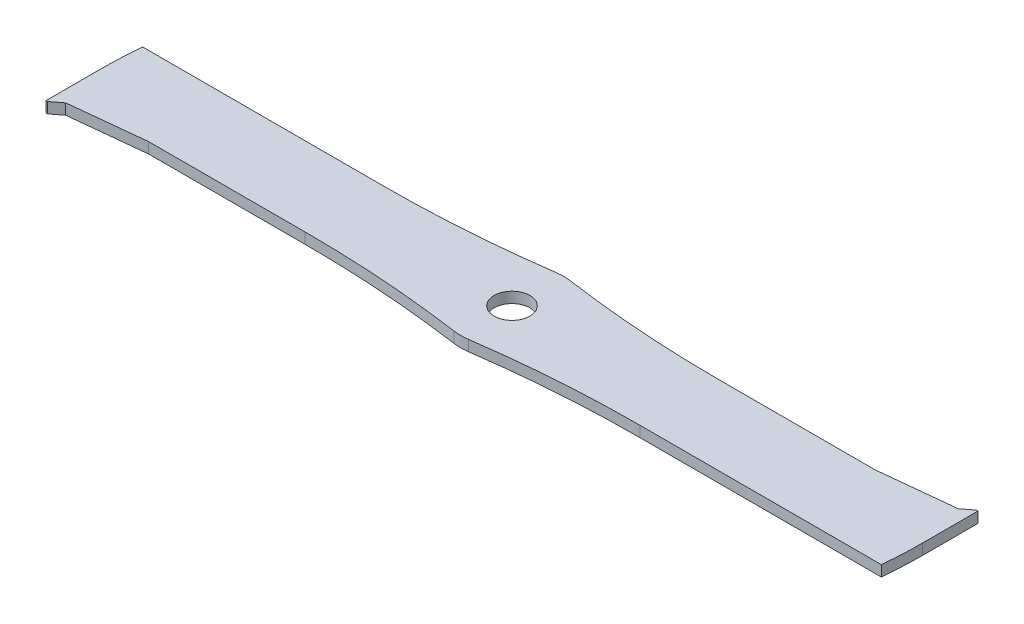
ISO-10303-21;
HEADER;
FILE_DESCRIPTION(('STEP AP214'),'2;1');
FILE_NAME('part.step','',(''),(''),'','','');
FILE_SCHEMA(('AUTOMOTIVE_DESIGN { 1 0 10303 214 1 1 1 1 }'));
ENDSEC;
DATA;
#1=APPLICATION_CONTEXT('core data for automotive mechanical design processes');
#2=APPLICATION_PROTOCOL_DEFINITION('international standard','automotive_design',2000,#1);
#3=PRODUCT_CONTEXT('',#1,'mechanical');
#4=PRODUCT('Part','Part','',(#3));
#5=PRODUCT_RELATED_PRODUCT_CATEGORY('part','',(#4));
#6=PRODUCT_DEFINITION_FORMATION('','',#4);
#7=PRODUCT_DEFINITION_CONTEXT('part definition',#1,'design');
#8=PRODUCT_DEFINITION('design','',#6,#7);
#9=PRODUCT_DEFINITION_SHAPE('','',#8);
#10=(LENGTH_UNIT() NAMED_UNIT(*) SI_UNIT(.MILLI.,.METRE.));
#11=(NAMED_UNIT(*) PLANE_ANGLE_UNIT() SI_UNIT($,.RADIAN.));
#12=(NAMED_UNIT(*) SI_UNIT($,.STERADIAN.) SOLID_ANGLE_UNIT());
#13=UNCERTAINTY_MEASURE_WITH_UNIT(LENGTH_MEASURE(1.E-05),#10,'distance_accuracy_value','');
#14=(GEOMETRIC_REPRESENTATION_CONTEXT(3) GLOBAL_UNCERTAINTY_ASSIGNED_CONTEXT((#13)) GLOBAL_UNIT_ASSIGNED_CONTEXT((#10,
#11,#12)) REPRESENTATION_CONTEXT('',''));
#15=CARTESIAN_POINT('',(0.,0.,0.));
#16=DIRECTION('',(0.,0.,1.));
#17=DIRECTION('',(1.,0.,0.));
#18=AXIS2_PLACEMENT_3D('',#15,#16,#17);
#19=CARTESIAN_POINT('',(-165.1,2.159,15.875));
#20=DIRECTION('',(1.,0.,0.));
#21=DIRECTION('',(0.,0.,-1.));
#22=AXIS2_PLACEMENT_3D('',#19,#20,#21);
#23=PLANE('',#22);
#24=DIRECTION('',(0.,-1.,0.));
#25=VECTOR('',#24,1.);
#26=CARTESIAN_POINT('',(-165.1,2.159,0.));
#27=LINE('',#26,#25);
#28=CARTESIAN_POINT('',(-165.1,2.159,0.));
#29=VERTEX_POINT('',#28);
#30=CARTESIAN_POINT('',(-165.1,-2.159,0.));
#31=VERTEX_POINT('',#30);
#32=EDGE_CURVE('E172',#29,#31,#27,.T.);
#33=ORIENTED_EDGE('',*,*,#32,.T.);
#34=DIRECTION('',(0.,0.,1.));
#35=VECTOR('',#34,1.);
#36=CARTESIAN_POINT('',(-165.1,-2.159,15.875));
#37=LINE('',#36,#35);
#38=CARTESIAN_POINT('',(-165.1,-2.159,22.225));
#39=VERTEX_POINT('',#38);
#40=EDGE_CURVE('E210',#31,#39,#37,.T.);
#41=ORIENTED_EDGE('',*,*,#40,.T.);
#42=DIRECTION('',(0.,-1.,0.));
#43=VECTOR('',#42,1.);
#44=CARTESIAN_POINT('',(-165.1,37.6565791428091,22.225));
#45=LINE('',#44,#43);
#46=CARTESIAN_POINT('',(-165.1,2.159,22.225));
#47=VERTEX_POINT('',#46);
#48=EDGE_CURVE('E193',#47,#39,#45,.T.);
#49=ORIENTED_EDGE('',*,*,#48,.F.);
#50=DIRECTION('',(0.,0.,1.));
#51=VECTOR('',#50,1.);
#52=CARTESIAN_POINT('',(-165.1,2.159,15.875));
#53=LINE('',#52,#51);
#54=EDGE_CURVE('E186',#29,#47,#53,.T.);
#55=ORIENTED_EDGE('',*,*,#54,.F.);
#56=EDGE_LOOP('',(#33,#41,#49,#55));
#57=FACE_BOUND('',#56,.T.);
#58=ADVANCED_FACE('F39',(#57),#23,.F.);
#59=CARTESIAN_POINT('',(165.1,2.159,15.875));
#60=DIRECTION('',(-1.,0.,0.));
#61=DIRECTION('',(0.,0.,1.));
#62=AXIS2_PLACEMENT_3D('',#59,#60,#61);
#63=PLANE('',#62);
#64=DIRECTION('',(0.,-1.,0.));
#65=VECTOR('',#64,1.);
#66=CARTESIAN_POINT('',(165.1,2.159,0.));
#67=LINE('',#66,#65);
#68=CARTESIAN_POINT('',(165.1,2.159,0.));
#69=VERTEX_POINT('',#68);
#70=CARTESIAN_POINT('',(165.1,-2.159,0.));
#71=VERTEX_POINT('',#70);
#72=EDGE_CURVE('E330',#69,#71,#67,.T.);
#73=ORIENTED_EDGE('',*,*,#72,.T.);
#74=DIRECTION('',(0.,0.,-1.));
#75=VECTOR('',#74,1.);
#76=CARTESIAN_POINT('',(165.1,-2.159,15.875));
#77=LINE('',#76,#75);
#78=CARTESIAN_POINT('',(165.1,-2.159,-22.225));
#79=VERTEX_POINT('',#78);
#80=EDGE_CURVE('E204',#71,#79,#77,.T.);
#81=ORIENTED_EDGE('',*,*,#80,.T.);
#82=DIRECTION('',(0.,-1.,0.));
#83=VECTOR('',#82,1.);
#84=CARTESIAN_POINT('',(165.1,37.6565791428091,-22.225));
#85=LINE('',#84,#83);
#86=CARTESIAN_POINT('',(165.1,2.159,-22.225));
#87=VERTEX_POINT('',#86);
#88=EDGE_CURVE('E315',#87,#79,#85,.T.);
#89=ORIENTED_EDGE('',*,*,#88,.F.);
#90=DIRECTION('',(0.,0.,-1.));
#91=VECTOR('',#90,1.);
#92=CARTESIAN_POINT('',(165.1,2.159,15.875));
#93=LINE('',#92,#91);
#94=EDGE_CURVE('E215',#69,#87,#93,.T.);
#95=ORIENTED_EDGE('',*,*,#94,.F.);
#96=EDGE_LOOP('',(#73,#81,#89,#95));
#97=FACE_BOUND('',#96,.T.);
#98=ADVANCED_FACE('F380',(#97),#63,.F.);
#99=CARTESIAN_POINT('',(-165.1,2.159,-15.875));
#100=DIRECTION('',(0.,0.,1.));
#101=DIRECTION('',(1.,0.,0.));
#102=AXIS2_PLACEMENT_3D('',#99,#100,#101);
#103=PLANE('',#102);
#104=DIRECTION('',(-1.,0.,0.));
#105=VECTOR('',#104,1.);
#106=CARTESIAN_POINT('',(-165.1,2.159,-15.875));
#107=LINE('',#106,#105);
#108=CARTESIAN_POINT('',(130.175000000001,2.159,-15.875));
#109=VERTEX_POINT('',#108);
#110=CARTESIAN_POINT('',(67.2957709016692,2.159,-15.875));
#111=VERTEX_POINT('',#110);
#112=EDGE_CURVE('E195',#109,#111,#107,.T.);
#113=ORIENTED_EDGE('',*,*,#112,.F.);
#114=DIRECTION('',(0.,-1.,0.));
#115=VECTOR('',#114,1.);
#116=CARTESIAN_POINT('',(130.175,37.6565791428091,-15.875));
#117=LINE('',#116,#115);
#118=CARTESIAN_POINT('',(130.175000000001,-2.159,-15.875));
#119=VERTEX_POINT('',#118);
#120=EDGE_CURVE('E308',#109,#119,#117,.T.);
#121=ORIENTED_EDGE('',*,*,#120,.T.);
#122=DIRECTION('',(-1.,0.,0.));
#123=VECTOR('',#122,1.);
#124=CARTESIAN_POINT('',(-165.1,-2.159,-15.875));
#125=LINE('',#124,#123);
#126=CARTESIAN_POINT('',(67.2957709016692,-2.159,-15.875));
#127=VERTEX_POINT('',#126);
#128=EDGE_CURVE('E208',#119,#127,#125,.T.);
#129=ORIENTED_EDGE('',*,*,#128,.T.);
#130=DIRECTION('',(0.,1.,0.));
#131=VECTOR('',#130,1.);
#132=CARTESIAN_POINT('',(67.2957709016692,2.159,-15.875));
#133=LINE('',#132,#131);
#134=EDGE_CURVE('E225',#127,#111,#133,.T.);
#135=ORIENTED_EDGE('',*,*,#134,.T.);
#136=EDGE_LOOP('',(#113,#121,#129,#135));
#137=FACE_BOUND('',#136,.T.);
#138=ADVANCED_FACE('F399',(#137),#103,.F.);
#139=CARTESIAN_POINT('',(-165.1,2.159,15.875));
#140=DIRECTION('',(0.,0.,-1.));
#141=DIRECTION('',(-1.,0.,0.));
#142=AXIS2_PLACEMENT_3D('',#139,#140,#141);
#143=PLANE('',#142);
#144=DIRECTION('',(1.,0.,0.));
#145=VECTOR('',#144,1.);
#146=CARTESIAN_POINT('',(-165.1,2.159,15.875));
#147=LINE('',#146,#145);
#148=CARTESIAN_POINT('',(-130.175000000003,2.159,15.8750000000001));
#149=VERTEX_POINT('',#148);
#150=CARTESIAN_POINT('',(-67.2957709016691,2.159,15.875));
#151=VERTEX_POINT('',#150);
#152=EDGE_CURVE('E198',#149,#151,#147,.T.);
#153=ORIENTED_EDGE('',*,*,#152,.F.);
#154=DIRECTION('',(0.,-1.,0.));
#155=VECTOR('',#154,1.);
#156=CARTESIAN_POINT('',(-130.175,37.6565791428091,15.875));
#157=LINE('',#156,#155);
#158=CARTESIAN_POINT('',(-130.175000000003,-2.159,15.8750000000001));
#159=VERTEX_POINT('',#158);
#160=EDGE_CURVE('E285',#149,#159,#157,.T.);
#161=ORIENTED_EDGE('',*,*,#160,.T.);
#162=DIRECTION('',(1.,0.,0.));
#163=VECTOR('',#162,1.);
#164=CARTESIAN_POINT('',(-165.1,-2.159,15.875));
#165=LINE('',#164,#163);
#166=CARTESIAN_POINT('',(-67.2957709016691,-2.159,15.875));
#167=VERTEX_POINT('',#166);
#168=EDGE_CURVE('E213',#159,#167,#165,.T.);
#169=ORIENTED_EDGE('',*,*,#168,.T.);
#170=DIRECTION('',(0.,1.,0.));
#171=VECTOR('',#170,1.);
#172=CARTESIAN_POINT('',(-67.2957709016691,2.159,15.875));
#173=LINE('',#172,#171);
#174=EDGE_CURVE('E203',#167,#151,#173,.T.);
#175=ORIENTED_EDGE('',*,*,#174,.T.);
#176=EDGE_LOOP('',(#153,#161,#169,#175));
#177=FACE_BOUND('',#176,.T.);
#178=ADVANCED_FACE('F361',(#177),#143,.F.);
#179=CARTESIAN_POINT('',(0.,2.159,0.));
#180=DIRECTION('',(0.,-1.,0.));
#181=DIRECTION('',(0.,0.,-1.));
#182=AXIS2_PLACEMENT_3D('',#179,#180,#181);
#183=PLANE('',#182);
#184=CARTESIAN_POINT('',(-67.2957709016691,2.159,-15.875));
#185=VERTEX_POINT('',#184);
#186=CARTESIAN_POINT('',(-164.335006541516,2.159,-15.875));
#187=VERTEX_POINT('',#186);
#188=EDGE_CURVE('E189',#185,#187,#107,.T.);
#189=ORIENTED_EDGE('',*,*,#188,.T.);
#190=CARTESIAN_POINT('',(1.16573417585641E-11,2.159,0.));
#191=DIRECTION('',(0.,1.,0.));
#192=DIRECTION('',(0.,0.,-1.));
#193=AXIS2_PLACEMENT_3D('',#190,#191,#192);
#194=CIRCLE('',#193,165.100000000012);
#195=EDGE_CURVE('E175',#187,#29,#194,.T.);
#196=ORIENTED_EDGE('',*,*,#195,.T.);
#197=ORIENTED_EDGE('',*,*,#54,.T.);
#198=DIRECTION('',(1.,0.,0.));
#199=VECTOR('',#198,1.);
#200=CARTESIAN_POINT('',(-165.1,2.159,22.225));
#201=LINE('',#200,#199);
#202=CARTESIAN_POINT('',(-164.465,2.159,22.225));
#203=VERTEX_POINT('',#202);
#204=EDGE_CURVE('E284',#47,#203,#201,.T.);
#205=ORIENTED_EDGE('',*,*,#204,.T.);
#206=DIRECTION('',(0.792623989104601,0.,-0.609710760849692));
#207=VECTOR('',#206,1.);
#208=CARTESIAN_POINT('',(-164.465,2.159,22.225));
#209=LINE('',#208,#207);
#210=CARTESIAN_POINT('',(-160.3375,2.159,19.05));
#211=VERTEX_POINT('',#210);
#212=EDGE_CURVE('E293',#203,#211,#209,.T.);
#213=ORIENTED_EDGE('',*,*,#212,.T.);
#214=DIRECTION('',(0.994505452921406,0.,-0.104684784518043));
#215=VECTOR('',#214,1.);
#216=CARTESIAN_POINT('',(-160.3375,2.159,19.05));
#217=LINE('',#216,#215);
#218=EDGE_CURVE('E266',#211,#149,#217,.T.);
#219=ORIENTED_EDGE('',*,*,#218,.T.);
#220=ORIENTED_EDGE('',*,*,#152,.T.);
#221=CARTESIAN_POINT('',(-67.2957709016691,2.159,473.075));
#222=DIRECTION('',(0.,-1.,0.));
#223=DIRECTION('',(0.,0.,-1.));
#224=AXIS2_PLACEMENT_3D('',#221,#222,#223);
#225=CIRCLE('',#224,457.2);
#226=CARTESIAN_POINT('',(-2.90646186618505,2.159,20.4318106312292));
#227=VERTEX_POINT('',#226);
#228=EDGE_CURVE('E235',#151,#227,#225,.T.);
#229=ORIENTED_EDGE('',*,*,#228,.T.);
#230=CARTESIAN_POINT('',(0.,2.159,0.));
#231=DIRECTION('',(0.,1.,0.));
#232=DIRECTION('',(0.,0.,1.));
#233=AXIS2_PLACEMENT_3D('',#230,#231,#232);
#234=CIRCLE('',#233,20.6375);
#235=CARTESIAN_POINT('',(2.90646186618505,2.159,20.4318106312292));
#236=VERTEX_POINT('',#235);
#237=EDGE_CURVE('E281',#227,#236,#234,.T.);
#238=ORIENTED_EDGE('',*,*,#237,.T.);
#239=CARTESIAN_POINT('',(67.2957709016691,2.159,473.075));
#240=DIRECTION('',(0.,-1.,0.));
#241=DIRECTION('',(0.,0.,-1.));
#242=AXIS2_PLACEMENT_3D('',#239,#240,#241);
#243=CIRCLE('',#242,457.2);
#244=CARTESIAN_POINT('',(67.2957709016692,2.159,15.875));
#245=VERTEX_POINT('',#244);
#246=EDGE_CURVE('E242',#236,#245,#243,.T.);
#247=ORIENTED_EDGE('',*,*,#246,.T.);
#248=CARTESIAN_POINT('',(164.335006541516,2.159,15.875));
#249=VERTEX_POINT('',#248);
#250=EDGE_CURVE('E194',#245,#249,#147,.T.);
#251=ORIENTED_EDGE('',*,*,#250,.T.);
#252=CARTESIAN_POINT('',(2.75751643741273E-11,2.159,2.00707506170517E-12));
#253=DIRECTION('',(0.,1.,0.));
#254=DIRECTION('',(0.,0.,1.));
#255=AXIS2_PLACEMENT_3D('',#252,#253,#254);
#256=CIRCLE('',#255,165.099999999972);
#257=EDGE_CURVE('E62',#249,#69,#256,.T.);
#258=ORIENTED_EDGE('',*,*,#257,.T.);
#259=ORIENTED_EDGE('',*,*,#94,.T.);
#260=DIRECTION('',(-1.,0.,0.));
#261=VECTOR('',#260,1.);
#262=CARTESIAN_POINT('',(165.1,2.159,-22.225));
#263=LINE('',#262,#261);
#264=CARTESIAN_POINT('',(164.465,2.159,-22.225));
#265=VERTEX_POINT('',#264);
#266=EDGE_CURVE('E307',#87,#265,#263,.T.);
#267=ORIENTED_EDGE('',*,*,#266,.T.);
#268=DIRECTION('',(-0.7926239891046,0.,0.609710760849692));
#269=VECTOR('',#268,1.);
#270=CARTESIAN_POINT('',(164.465,2.159,-22.225));
#271=LINE('',#270,#269);
#272=CARTESIAN_POINT('',(160.3375,2.159,-19.05));
#273=VERTEX_POINT('',#272);
#274=EDGE_CURVE('E318',#265,#273,#271,.T.);
#275=ORIENTED_EDGE('',*,*,#274,.T.);
#276=DIRECTION('',(-0.994505452921406,0.,0.104684784518043));
#277=VECTOR('',#276,1.);
#278=CARTESIAN_POINT('',(160.3375,2.159,-19.05));
#279=LINE('',#278,#277);
#280=EDGE_CURVE('E302',#273,#109,#279,.T.);
#281=ORIENTED_EDGE('',*,*,#280,.T.);
#282=ORIENTED_EDGE('',*,*,#112,.T.);
#283=CARTESIAN_POINT('',(67.2957709016691,2.159,-473.075));
#284=DIRECTION('',(0.,-1.,0.));
#285=DIRECTION('',(0.,0.,-1.));
#286=AXIS2_PLACEMENT_3D('',#283,#284,#285);
#287=CIRCLE('',#286,457.2);
#288=CARTESIAN_POINT('',(2.90646186618505,2.159,-20.4318106312292));
#289=VERTEX_POINT('',#288);
#290=EDGE_CURVE('E244',#111,#289,#287,.T.);
#291=ORIENTED_EDGE('',*,*,#290,.T.);
#292=CARTESIAN_POINT('',(-2.90646186618505,2.159,-20.4318106312292));
#293=VERTEX_POINT('',#292);
#294=EDGE_CURVE('E269',#289,#293,#234,.T.);
#295=ORIENTED_EDGE('',*,*,#294,.T.);
#296=CARTESIAN_POINT('',(-67.2957709016691,2.159,-473.075));
#297=DIRECTION('',(0.,-1.,0.));
#298=DIRECTION('',(0.,0.,-1.));
#299=AXIS2_PLACEMENT_3D('',#296,#297,#298);
#300=CIRCLE('',#299,457.2);
#301=EDGE_CURVE('E11',#293,#185,#300,.T.);
#302=ORIENTED_EDGE('',*,*,#301,.T.);
#303=EDGE_LOOP('',(#189,#196,#197,#205,#213,#219,#220,#229,#238,#247,#251,#258,#259,#267,#275,
#281,#282,#291,#295,#302));
#304=FACE_BOUND('',#303,.T.);
#305=CARTESIAN_POINT('',(0.,2.159,0.));
#306=DIRECTION('',(0.,1.,0.));
#307=DIRECTION('',(0.,0.,1.));
#308=AXIS2_PLACEMENT_3D('',#305,#306,#307);
#309=CIRCLE('',#308,7.19455);
#310=CARTESIAN_POINT('',(0.,2.159,7.19455));
#311=VERTEX_POINT('',#310);
#312=EDGE_CURVE('E207',#311,#311,#309,.T.);
#313=ORIENTED_EDGE('',*,*,#312,.F.);
#314=EDGE_LOOP('',(#313));
#315=FACE_BOUND('',#314,.T.);
#316=ADVANCED_FACE('F184',(#304,#315),#183,.F.);
#317=CARTESIAN_POINT('',(0.,-2.159,0.));
#318=DIRECTION('',(0.,-1.,0.));
#319=DIRECTION('',(0.,0.,-1.));
#320=AXIS2_PLACEMENT_3D('',#317,#318,#319);
#321=PLANE('',#320);
#322=CARTESIAN_POINT('',(1.16573417585641E-11,-2.159,0.));
#323=DIRECTION('',(0.,1.,0.));
#324=DIRECTION('',(0.,0.,-1.));
#325=AXIS2_PLACEMENT_3D('',#322,#323,#324);
#326=CIRCLE('',#325,165.100000000012);
#327=CARTESIAN_POINT('',(-164.335006541516,-2.159,-15.875));
#328=VERTEX_POINT('',#327);
#329=EDGE_CURVE('E54',#328,#31,#326,.T.);
#330=ORIENTED_EDGE('',*,*,#329,.F.);
#331=CARTESIAN_POINT('',(-67.2957709016691,-2.159,-15.875));
#332=VERTEX_POINT('',#331);
#333=EDGE_CURVE('E206',#332,#328,#125,.T.);
#334=ORIENTED_EDGE('',*,*,#333,.F.);
#335=CARTESIAN_POINT('',(-67.2957709016691,-2.159,-473.075));
#336=DIRECTION('',(0.,-1.,0.));
#337=DIRECTION('',(0.,0.,-1.));
#338=AXIS2_PLACEMENT_3D('',#335,#336,#337);
#339=CIRCLE('',#338,457.2);
#340=CARTESIAN_POINT('',(-2.90646186618505,-2.159,-20.4318106312292));
#341=VERTEX_POINT('',#340);
#342=EDGE_CURVE('E47',#332,#341,#339,.F.);
#343=ORIENTED_EDGE('',*,*,#342,.T.);
#344=CARTESIAN_POINT('',(0.,-2.159,0.));
#345=DIRECTION('',(0.,-1.,0.));
#346=DIRECTION('',(0.,0.,-1.));
#347=AXIS2_PLACEMENT_3D('',#344,#345,#346);
#348=CIRCLE('',#347,20.6375);
#349=CARTESIAN_POINT('',(2.90646186618505,-2.159,-20.4318106312292));
#350=VERTEX_POINT('',#349);
#351=EDGE_CURVE('E254',#350,#341,#348,.F.);
#352=ORIENTED_EDGE('',*,*,#351,.F.);
#353=CARTESIAN_POINT('',(67.2957709016691,-2.159,-473.075));
#354=DIRECTION('',(0.,-1.,0.));
#355=DIRECTION('',(0.,0.,-1.));
#356=AXIS2_PLACEMENT_3D('',#353,#354,#355);
#357=CIRCLE('',#356,457.2);
#358=EDGE_CURVE('E246',#350,#127,#357,.F.);
#359=ORIENTED_EDGE('',*,*,#358,.T.);
#360=ORIENTED_EDGE('',*,*,#128,.F.);
#361=DIRECTION('',(0.994505452921406,0.,-0.104684784518043));
#362=VECTOR('',#361,1.);
#363=CARTESIAN_POINT('',(160.3375,-2.159,-19.05));
#364=LINE('',#363,#362);
#365=CARTESIAN_POINT('',(160.3375,-2.159,-19.05));
#366=VERTEX_POINT('',#365);
#367=EDGE_CURVE('E324',#119,#366,#364,.T.);
#368=ORIENTED_EDGE('',*,*,#367,.T.);
#369=DIRECTION('',(0.7926239891046,0.,-0.609710760849692));
#370=VECTOR('',#369,1.);
#371=CARTESIAN_POINT('',(164.465,-2.159,-22.225));
#372=LINE('',#371,#370);
#373=CARTESIAN_POINT('',(164.465,-2.159,-22.225));
#374=VERTEX_POINT('',#373);
#375=EDGE_CURVE('E321',#366,#374,#372,.T.);
#376=ORIENTED_EDGE('',*,*,#375,.T.);
#377=DIRECTION('',(1.,0.,0.));
#378=VECTOR('',#377,1.);
#379=CARTESIAN_POINT('',(165.1,-2.159,-22.225));
#380=LINE('',#379,#378);
#381=EDGE_CURVE('E311',#374,#79,#380,.T.);
#382=ORIENTED_EDGE('',*,*,#381,.T.);
#383=ORIENTED_EDGE('',*,*,#80,.F.);
#384=CARTESIAN_POINT('',(2.75751643741273E-11,-2.159,2.00707506170517E-12));
#385=DIRECTION('',(0.,1.,0.));
#386=DIRECTION('',(0.,0.,1.));
#387=AXIS2_PLACEMENT_3D('',#384,#385,#386);
#388=CIRCLE('',#387,165.099999999972);
#389=CARTESIAN_POINT('',(164.335006541516,-2.159,15.875));
#390=VERTEX_POINT('',#389);
#391=EDGE_CURVE('E334',#390,#71,#388,.T.);
#392=ORIENTED_EDGE('',*,*,#391,.F.);
#393=CARTESIAN_POINT('',(67.2957709016692,-2.159,15.875));
#394=VERTEX_POINT('',#393);
#395=EDGE_CURVE('E212',#394,#390,#165,.T.);
#396=ORIENTED_EDGE('',*,*,#395,.F.);
#397=CARTESIAN_POINT('',(67.2957709016691,-2.159,473.075));
#398=DIRECTION('',(0.,-1.,0.));
#399=DIRECTION('',(0.,0.,-1.));
#400=AXIS2_PLACEMENT_3D('',#397,#398,#399);
#401=CIRCLE('',#400,457.2);
#402=CARTESIAN_POINT('',(2.90646186618505,-2.159,20.4318106312292));
#403=VERTEX_POINT('',#402);
#404=EDGE_CURVE('E240',#394,#403,#401,.F.);
#405=ORIENTED_EDGE('',*,*,#404,.T.);
#406=CARTESIAN_POINT('',(-2.90646186618505,-2.159,20.4318106312292));
#407=VERTEX_POINT('',#406);
#408=EDGE_CURVE('E265',#407,#403,#348,.F.);
#409=ORIENTED_EDGE('',*,*,#408,.F.);
#410=CARTESIAN_POINT('',(-67.2957709016691,-2.159,473.075));
#411=DIRECTION('',(0.,-1.,0.));
#412=DIRECTION('',(0.,0.,-1.));
#413=AXIS2_PLACEMENT_3D('',#410,#411,#412);
#414=CIRCLE('',#413,457.2);
#415=EDGE_CURVE('E237',#407,#167,#414,.F.);
#416=ORIENTED_EDGE('',*,*,#415,.T.);
#417=ORIENTED_EDGE('',*,*,#168,.F.);
#418=DIRECTION('',(-0.994505452921406,0.,0.104684784518043));
#419=VECTOR('',#418,1.);
#420=CARTESIAN_POINT('',(-160.3375,-2.159,19.05));
#421=LINE('',#420,#419);
#422=CARTESIAN_POINT('',(-160.3375,-2.159,19.05));
#423=VERTEX_POINT('',#422);
#424=EDGE_CURVE('E299',#159,#423,#421,.T.);
#425=ORIENTED_EDGE('',*,*,#424,.T.);
#426=DIRECTION('',(-0.792623989104601,0.,0.609710760849692));
#427=VECTOR('',#426,1.);
#428=CARTESIAN_POINT('',(-164.465,-2.159,22.225));
#429=LINE('',#428,#427);
#430=CARTESIAN_POINT('',(-164.465,-2.159,22.225));
#431=VERTEX_POINT('',#430);
#432=EDGE_CURVE('E296',#423,#431,#429,.T.);
#433=ORIENTED_EDGE('',*,*,#432,.T.);
#434=DIRECTION('',(-1.,0.,0.));
#435=VECTOR('',#434,1.);
#436=CARTESIAN_POINT('',(-165.1,-2.159,22.225));
#437=LINE('',#436,#435);
#438=EDGE_CURVE('E288',#431,#39,#437,.T.);
#439=ORIENTED_EDGE('',*,*,#438,.T.);
#440=ORIENTED_EDGE('',*,*,#40,.F.);
#441=EDGE_LOOP('',(#330,#334,#343,#352,#359,#360,#368,#376,#382,#383,#392,#396,#405,#409,#416,
#417,#425,#433,#439,#440));
#442=FACE_BOUND('',#441,.T.);
#443=CARTESIAN_POINT('',(0.,-2.159,0.));
#444=DIRECTION('',(0.,1.,0.));
#445=DIRECTION('',(0.,0.,1.));
#446=AXIS2_PLACEMENT_3D('',#443,#444,#445);
#447=CIRCLE('',#446,7.19455);
#448=CARTESIAN_POINT('',(0.,-2.159,7.19455));
#449=VERTEX_POINT('',#448);
#450=EDGE_CURVE('E275',#449,#449,#447,.T.);
#451=ORIENTED_EDGE('',*,*,#450,.T.);
#452=EDGE_LOOP('',(#451));
#453=FACE_BOUND('',#452,.T.);
#454=ADVANCED_FACE('F252',(#442,#453),#321,.T.);
#455=ORIENTED_EDGE('',*,*,#333,.T.);
#456=DIRECTION('',(0.,-1.,0.));
#457=VECTOR('',#456,1.);
#458=CARTESIAN_POINT('',(-164.335006541516,2.159,-15.875));
#459=LINE('',#458,#457);
#460=EDGE_CURVE('E180',#187,#328,#459,.T.);
#461=ORIENTED_EDGE('',*,*,#460,.F.);
#462=ORIENTED_EDGE('',*,*,#188,.F.);
#463=DIRECTION('',(0.,1.,0.));
#464=VECTOR('',#463,1.);
#465=CARTESIAN_POINT('',(-67.2957709016691,2.159,-15.875));
#466=LINE('',#465,#464);
#467=EDGE_CURVE('E232',#185,#332,#466,.F.);
#468=ORIENTED_EDGE('',*,*,#467,.T.);
#469=EDGE_LOOP('',(#455,#461,#462,#468));
#470=FACE_BOUND('',#469,.T.);
#471=ADVANCED_FACE('F271',(#470),#103,.F.);
#472=ORIENTED_EDGE('',*,*,#395,.T.);
#473=DIRECTION('',(0.,-1.,0.));
#474=VECTOR('',#473,1.);
#475=CARTESIAN_POINT('',(164.335006541516,2.159,15.875));
#476=LINE('',#475,#474);
#477=EDGE_CURVE('E327',#249,#390,#476,.T.);
#478=ORIENTED_EDGE('',*,*,#477,.F.);
#479=ORIENTED_EDGE('',*,*,#250,.F.);
#480=DIRECTION('',(0.,1.,0.));
#481=VECTOR('',#480,1.);
#482=CARTESIAN_POINT('',(67.2957709016692,2.159,15.875));
#483=LINE('',#482,#481);
#484=EDGE_CURVE('E222',#245,#394,#483,.F.);
#485=ORIENTED_EDGE('',*,*,#484,.T.);
#486=EDGE_LOOP('',(#472,#478,#479,#485));
#487=FACE_BOUND('',#486,.T.);
#488=ADVANCED_FACE('F375',(#487),#143,.F.);
#489=CARTESIAN_POINT('',(0.,2.159,0.));
#490=DIRECTION('',(0.,-1.,0.));
#491=DIRECTION('',(0.,0.,-1.));
#492=AXIS2_PLACEMENT_3D('',#489,#490,#491);
#493=CYLINDRICAL_SURFACE('',#492,7.19455);
#494=ORIENTED_EDGE('',*,*,#312,.T.);
#495=EDGE_LOOP('',(#494));
#496=FACE_BOUND('',#495,.T.);
#497=ORIENTED_EDGE('',*,*,#450,.F.);
#498=EDGE_LOOP('',(#497));
#499=FACE_BOUND('',#498,.T.);
#500=ADVANCED_FACE('F429',(#496,#499),#493,.F.);
#501=CARTESIAN_POINT('',(0.,-60.5306647869495,0.));
#502=DIRECTION('',(0.,1.,0.));
#503=DIRECTION('',(0.,0.,1.));
#504=AXIS2_PLACEMENT_3D('',#501,#502,#503);
#505=CYLINDRICAL_SURFACE('',#504,20.6375);
#506=ORIENTED_EDGE('',*,*,#237,.F.);
#507=DIRECTION('',(0.,1.,0.));
#508=VECTOR('',#507,1.);
#509=CARTESIAN_POINT('',(-2.90646186618505,-60.5306647869495,20.4318106312292));
#510=LINE('',#509,#508);
#511=EDGE_CURVE('E220',#227,#407,#510,.F.);
#512=ORIENTED_EDGE('',*,*,#511,.T.);
#513=ORIENTED_EDGE('',*,*,#408,.T.);
#514=DIRECTION('',(0.,1.,0.));
#515=VECTOR('',#514,1.);
#516=CARTESIAN_POINT('',(2.90646186618505,-60.5306647869495,20.4318106312292));
#517=LINE('',#516,#515);
#518=EDGE_CURVE('E218',#403,#236,#517,.T.);
#519=ORIENTED_EDGE('',*,*,#518,.T.);
#520=EDGE_LOOP('',(#506,#512,#513,#519));
#521=FACE_BOUND('',#520,.T.);
#522=ADVANCED_FACE('F424',(#521),#505,.T.);
#523=ORIENTED_EDGE('',*,*,#294,.F.);
#524=DIRECTION('',(0.,1.,0.));
#525=VECTOR('',#524,1.);
#526=CARTESIAN_POINT('',(2.90646186618505,-60.5306647869495,-20.4318106312292));
#527=LINE('',#526,#525);
#528=EDGE_CURVE('E230',#289,#350,#527,.F.);
#529=ORIENTED_EDGE('',*,*,#528,.T.);
#530=ORIENTED_EDGE('',*,*,#351,.T.);
#531=DIRECTION('',(0.,1.,0.));
#532=VECTOR('',#531,1.);
#533=CARTESIAN_POINT('',(-2.90646186618505,-60.5306647869495,-20.4318106312292));
#534=LINE('',#533,#532);
#535=EDGE_CURVE('E228',#341,#293,#534,.T.);
#536=ORIENTED_EDGE('',*,*,#535,.T.);
#537=EDGE_LOOP('',(#523,#529,#530,#536));
#538=FACE_BOUND('',#537,.T.);
#539=ADVANCED_FACE('F262',(#538),#505,.T.);
#540=CARTESIAN_POINT('',(-67.2957709016691,-60.5306647869495,473.075));
#541=DIRECTION('',(0.,1.,0.));
#542=DIRECTION('',(0.,0.,1.));
#543=AXIS2_PLACEMENT_3D('',#540,#541,#542);
#544=CYLINDRICAL_SURFACE('',#543,457.2);
#545=ORIENTED_EDGE('',*,*,#415,.F.);
#546=ORIENTED_EDGE('',*,*,#511,.F.);
#547=ORIENTED_EDGE('',*,*,#228,.F.);
#548=ORIENTED_EDGE('',*,*,#174,.F.);
#549=EDGE_LOOP('',(#545,#546,#547,#548));
#550=FACE_BOUND('',#549,.T.);
#551=ADVANCED_FACE('F360',(#550),#544,.F.);
#552=CARTESIAN_POINT('',(67.2957709016691,-60.5306647869495,473.075));
#553=DIRECTION('',(0.,1.,0.));
#554=DIRECTION('',(0.,0.,1.));
#555=AXIS2_PLACEMENT_3D('',#552,#553,#554);
#556=CYLINDRICAL_SURFACE('',#555,457.2);
#557=ORIENTED_EDGE('',*,*,#246,.F.);
#558=ORIENTED_EDGE('',*,*,#518,.F.);
#559=ORIENTED_EDGE('',*,*,#404,.F.);
#560=ORIENTED_EDGE('',*,*,#484,.F.);
#561=EDGE_LOOP('',(#557,#558,#559,#560));
#562=FACE_BOUND('',#561,.T.);
#563=ADVANCED_FACE('F372',(#562),#556,.F.);
#564=CARTESIAN_POINT('',(67.2957709016691,-60.5306647869495,-473.075));
#565=DIRECTION('',(0.,1.,0.));
#566=DIRECTION('',(0.,0.,1.));
#567=AXIS2_PLACEMENT_3D('',#564,#565,#566);
#568=CYLINDRICAL_SURFACE('',#567,457.2);
#569=ORIENTED_EDGE('',*,*,#358,.F.);
#570=ORIENTED_EDGE('',*,*,#528,.F.);
#571=ORIENTED_EDGE('',*,*,#290,.F.);
#572=ORIENTED_EDGE('',*,*,#134,.F.);
#573=EDGE_LOOP('',(#569,#570,#571,#572));
#574=FACE_BOUND('',#573,.T.);
#575=ADVANCED_FACE('F402',(#574),#568,.F.);
#576=CARTESIAN_POINT('',(-67.2957709016691,-60.5306647869495,-473.075));
#577=DIRECTION('',(0.,1.,0.));
#578=DIRECTION('',(0.,0.,1.));
#579=AXIS2_PLACEMENT_3D('',#576,#577,#578);
#580=CYLINDRICAL_SURFACE('',#579,457.2);
#581=ORIENTED_EDGE('',*,*,#301,.F.);
#582=ORIENTED_EDGE('',*,*,#535,.F.);
#583=ORIENTED_EDGE('',*,*,#342,.F.);
#584=ORIENTED_EDGE('',*,*,#467,.F.);
#585=EDGE_LOOP('',(#581,#582,#583,#584));
#586=FACE_BOUND('',#585,.T.);
#587=ADVANCED_FACE('F41',(#586),#580,.F.);
#588=CARTESIAN_POINT('',(-165.1,37.6565791428091,22.225));
#589=DIRECTION('',(0.,0.,1.));
#590=DIRECTION('',(1.,0.,0.));
#591=AXIS2_PLACEMENT_3D('',#588,#589,#590);
#592=PLANE('',#591);
#593=ORIENTED_EDGE('',*,*,#204,.F.);
#594=ORIENTED_EDGE('',*,*,#48,.T.);
#595=ORIENTED_EDGE('',*,*,#438,.F.);
#596=DIRECTION('',(0.,-1.,0.));
#597=VECTOR('',#596,1.);
#598=CARTESIAN_POINT('',(-164.465,37.6565791428091,22.225));
#599=LINE('',#598,#597);
#600=EDGE_CURVE('E290',#203,#431,#599,.T.);
#601=ORIENTED_EDGE('',*,*,#600,.F.);
#602=EDGE_LOOP('',(#593,#594,#595,#601));
#603=FACE_BOUND('',#602,.T.);
#604=ADVANCED_FACE('F340',(#603),#592,.T.);
#605=CARTESIAN_POINT('',(-164.465,37.6565791428091,22.225));
#606=DIRECTION('',(0.609710760849692,0.,0.7926239891046));
#607=DIRECTION('',(0.792623989104601,0.,-0.609710760849692));
#608=AXIS2_PLACEMENT_3D('',#605,#606,#607);
#609=PLANE('',#608);
#610=ORIENTED_EDGE('',*,*,#212,.F.);
#611=ORIENTED_EDGE('',*,*,#600,.T.);
#612=ORIENTED_EDGE('',*,*,#432,.F.);
#613=DIRECTION('',(0.,-1.,0.));
#614=VECTOR('',#613,1.);
#615=CARTESIAN_POINT('',(-160.3375,37.6565791428091,19.05));
#616=LINE('',#615,#614);
#617=EDGE_CURVE('E287',#211,#423,#616,.T.);
#618=ORIENTED_EDGE('',*,*,#617,.F.);
#619=EDGE_LOOP('',(#610,#611,#612,#618));
#620=FACE_BOUND('',#619,.T.);
#621=ADVANCED_FACE('F345',(#620),#609,.T.);
#622=CARTESIAN_POINT('',(-160.3375,37.6565791428091,19.05));
#623=DIRECTION('',(0.104684784518043,0.,0.994505452921406));
#624=DIRECTION('',(0.994505452921406,0.,-0.104684784518043));
#625=AXIS2_PLACEMENT_3D('',#622,#623,#624);
#626=PLANE('',#625);
#627=ORIENTED_EDGE('',*,*,#218,.F.);
#628=ORIENTED_EDGE('',*,*,#617,.T.);
#629=ORIENTED_EDGE('',*,*,#424,.F.);
#630=ORIENTED_EDGE('',*,*,#160,.F.);
#631=EDGE_LOOP('',(#627,#628,#629,#630));
#632=FACE_BOUND('',#631,.T.);
#633=ADVANCED_FACE('F351',(#632),#626,.T.);
#634=CARTESIAN_POINT('',(165.1,37.6565791428091,-22.225));
#635=DIRECTION('',(0.,0.,-1.));
#636=DIRECTION('',(-1.,0.,0.));
#637=AXIS2_PLACEMENT_3D('',#634,#635,#636);
#638=PLANE('',#637);
#639=ORIENTED_EDGE('',*,*,#266,.F.);
#640=ORIENTED_EDGE('',*,*,#88,.T.);
#641=ORIENTED_EDGE('',*,*,#381,.F.);
#642=DIRECTION('',(0.,-1.,0.));
#643=VECTOR('',#642,1.);
#644=CARTESIAN_POINT('',(164.465,37.6565791428091,-22.225));
#645=LINE('',#644,#643);
#646=EDGE_CURVE('E313',#265,#374,#645,.T.);
#647=ORIENTED_EDGE('',*,*,#646,.F.);
#648=EDGE_LOOP('',(#639,#640,#641,#647));
#649=FACE_BOUND('',#648,.T.);
#650=ADVANCED_FACE('F384',(#649),#638,.T.);
#651=CARTESIAN_POINT('',(164.465,37.6565791428091,-22.225));
#652=DIRECTION('',(-0.609710760849692,0.,-0.7926239891046));
#653=DIRECTION('',(-0.7926239891046,0.,0.609710760849692));
#654=AXIS2_PLACEMENT_3D('',#651,#652,#653);
#655=PLANE('',#654);
#656=ORIENTED_EDGE('',*,*,#274,.F.);
#657=ORIENTED_EDGE('',*,*,#646,.T.);
#658=ORIENTED_EDGE('',*,*,#375,.F.);
#659=DIRECTION('',(0.,-1.,0.));
#660=VECTOR('',#659,1.);
#661=CARTESIAN_POINT('',(160.3375,37.6565791428091,-19.05));
#662=LINE('',#661,#660);
#663=EDGE_CURVE('E310',#273,#366,#662,.T.);
#664=ORIENTED_EDGE('',*,*,#663,.F.);
#665=EDGE_LOOP('',(#656,#657,#658,#664));
#666=FACE_BOUND('',#665,.T.);
#667=ADVANCED_FACE('F392',(#666),#655,.T.);
#668=CARTESIAN_POINT('',(160.3375,37.6565791428091,-19.05));
#669=DIRECTION('',(-0.104684784518043,0.,-0.994505452921406));
#670=DIRECTION('',(-0.994505452921406,0.,0.104684784518043));
#671=AXIS2_PLACEMENT_3D('',#668,#669,#670);
#672=PLANE('',#671);
#673=ORIENTED_EDGE('',*,*,#280,.F.);
#674=ORIENTED_EDGE('',*,*,#663,.T.);
#675=ORIENTED_EDGE('',*,*,#367,.F.);
#676=ORIENTED_EDGE('',*,*,#120,.F.);
#677=EDGE_LOOP('',(#673,#674,#675,#676));
#678=FACE_BOUND('',#677,.T.);
#679=ADVANCED_FACE('F397',(#678),#672,.T.);
#680=CARTESIAN_POINT('',(2.75751643741273E-11,2.159,2.00707506170517E-12));
#681=DIRECTION('',(0.,-1.,0.));
#682=DIRECTION('',(0.,0.,-1.));
#683=AXIS2_PLACEMENT_3D('',#680,#681,#682);
#684=CYLINDRICAL_SURFACE('',#683,165.099999999972);
#685=ORIENTED_EDGE('',*,*,#391,.T.);
#686=ORIENTED_EDGE('',*,*,#72,.F.);
#687=ORIENTED_EDGE('',*,*,#257,.F.);
#688=ORIENTED_EDGE('',*,*,#477,.T.);
#689=EDGE_LOOP('',(#685,#686,#687,#688));
#690=FACE_BOUND('',#689,.T.);
#691=ADVANCED_FACE('F378',(#690),#684,.T.);
#692=CARTESIAN_POINT('',(1.16573417585641E-11,2.159,0.));
#693=DIRECTION('',(0.,-1.,0.));
#694=DIRECTION('',(0.,0.,-1.));
#695=AXIS2_PLACEMENT_3D('',#692,#693,#694);
#696=CYLINDRICAL_SURFACE('',#695,165.100000000012);
#697=ORIENTED_EDGE('',*,*,#329,.T.);
#698=ORIENTED_EDGE('',*,*,#32,.F.);
#699=ORIENTED_EDGE('',*,*,#195,.F.);
#700=ORIENTED_EDGE('',*,*,#460,.T.);
#701=EDGE_LOOP('',(#697,#698,#699,#700));
#702=FACE_BOUND('',#701,.T.);
#703=ADVANCED_FACE('F174',(#702),#696,.T.);
#704=CLOSED_SHELL('',(#58,#98,#138,#178,#316,#454,#471,#488,#500,#522,#539,#551,#563,#575,#587,
#604,#621,#633,#650,#667,#679,#691,#703));
#705=MANIFOLD_SOLID_BREP('B2',#704);
#706=ADVANCED_BREP_SHAPE_REPRESENTATION('',(#18,#705),#14);
#707=SHAPE_DEFINITION_REPRESENTATION(#9,#706);
ENDSEC;
END-ISO-10303-21;
